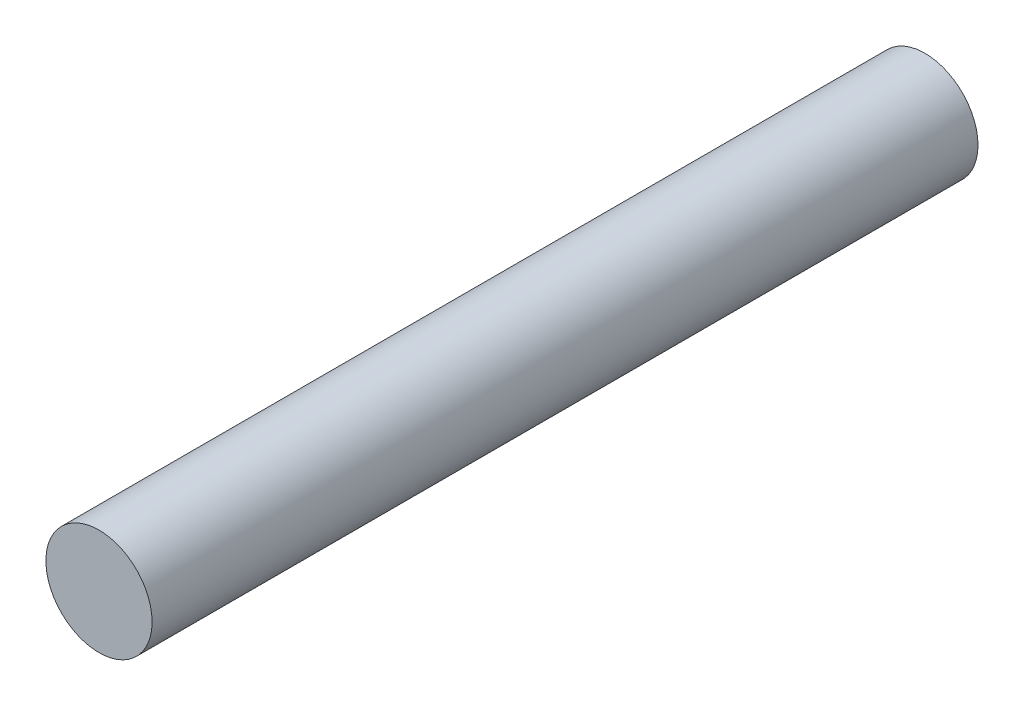
ISO-10303-21;
HEADER;
FILE_DESCRIPTION(('STEP AP214'),'2;1');
FILE_NAME('part.step','',(''),(''),'','','');
FILE_SCHEMA(('AUTOMOTIVE_DESIGN { 1 0 10303 214 1 1 1 1 }'));
ENDSEC;
DATA;
#1=APPLICATION_CONTEXT('core data for automotive mechanical design processes');
#2=APPLICATION_PROTOCOL_DEFINITION('international standard','automotive_design',2000,#1);
#3=PRODUCT_CONTEXT('',#1,'mechanical');
#4=PRODUCT('Part','Part','',(#3));
#5=PRODUCT_RELATED_PRODUCT_CATEGORY('part','',(#4));
#6=PRODUCT_DEFINITION_FORMATION('','',#4);
#7=PRODUCT_DEFINITION_CONTEXT('part definition',#1,'design');
#8=PRODUCT_DEFINITION('design','',#6,#7);
#9=PRODUCT_DEFINITION_SHAPE('','',#8);
#10=(LENGTH_UNIT() NAMED_UNIT(*) SI_UNIT(.MILLI.,.METRE.));
#11=(NAMED_UNIT(*) PLANE_ANGLE_UNIT() SI_UNIT($,.RADIAN.));
#12=(NAMED_UNIT(*) SI_UNIT($,.STERADIAN.) SOLID_ANGLE_UNIT());
#13=UNCERTAINTY_MEASURE_WITH_UNIT(LENGTH_MEASURE(1.E-05),#10,'distance_accuracy_value','');
#14=(GEOMETRIC_REPRESENTATION_CONTEXT(3) GLOBAL_UNCERTAINTY_ASSIGNED_CONTEXT((#13)) GLOBAL_UNIT_ASSIGNED_CONTEXT((#10,
#11,#12)) REPRESENTATION_CONTEXT('',''));
#15=CARTESIAN_POINT('',(0.,0.,0.));
#16=DIRECTION('',(0.,0.,1.));
#17=DIRECTION('',(1.,0.,0.));
#18=AXIS2_PLACEMENT_3D('',#15,#16,#17);
#19=CARTESIAN_POINT('',(0.,0.,140.));
#20=DIRECTION('',(0.,0.,-1.));
#21=DIRECTION('',(-1.,0.,0.));
#22=AXIS2_PLACEMENT_3D('',#19,#20,#21);
#23=CYLINDRICAL_SURFACE('',#22,9.);
#24=CARTESIAN_POINT('',(0.,0.,140.));
#25=DIRECTION('',(0.,0.,1.));
#26=DIRECTION('',(1.,0.,0.));
#27=AXIS2_PLACEMENT_3D('',#24,#25,#26);
#28=CIRCLE('',#27,9.);
#29=CARTESIAN_POINT('',(9.,0.,140.));
#30=VERTEX_POINT('',#29);
#31=EDGE_CURVE('E10',#30,#30,#28,.T.);
#32=ORIENTED_EDGE('',*,*,#31,.F.);
#33=EDGE_LOOP('',(#32));
#34=FACE_BOUND('',#33,.T.);
#35=CARTESIAN_POINT('',(0.,0.,0.));
#36=DIRECTION('',(0.,0.,1.));
#37=DIRECTION('',(1.,0.,0.));
#38=AXIS2_PLACEMENT_3D('',#35,#36,#37);
#39=CIRCLE('',#38,9.);
#40=CARTESIAN_POINT('',(9.,0.,0.));
#41=VERTEX_POINT('',#40);
#42=EDGE_CURVE('E36',#41,#41,#39,.T.);
#43=ORIENTED_EDGE('',*,*,#42,.T.);
#44=EDGE_LOOP('',(#43));
#45=FACE_BOUND('',#44,.T.);
#46=ADVANCED_FACE('F33',(#34,#45),#23,.T.);
#47=CARTESIAN_POINT('',(0.,0.,140.));
#48=DIRECTION('',(0.,0.,1.));
#49=DIRECTION('',(1.,0.,0.));
#50=AXIS2_PLACEMENT_3D('',#47,#48,#49);
#51=PLANE('',#50);
#52=ORIENTED_EDGE('',*,*,#31,.T.);
#53=EDGE_LOOP('',(#52));
#54=FACE_BOUND('',#53,.T.);
#55=ADVANCED_FACE('F48',(#54),#51,.T.);
#56=CARTESIAN_POINT('',(0.,0.,0.));
#57=DIRECTION('',(0.,0.,1.));
#58=DIRECTION('',(1.,0.,0.));
#59=AXIS2_PLACEMENT_3D('',#56,#57,#58);
#60=PLANE('',#59);
#61=ORIENTED_EDGE('',*,*,#42,.F.);
#62=EDGE_LOOP('',(#61));
#63=FACE_BOUND('',#62,.T.);
#64=ADVANCED_FACE('F46',(#63),#60,.F.);
#65=CLOSED_SHELL('',(#46,#55,#64));
#66=MANIFOLD_SOLID_BREP('B2',#65);
#67=ADVANCED_BREP_SHAPE_REPRESENTATION('',(#18,#66),#14);
#68=SHAPE_DEFINITION_REPRESENTATION(#9,#67);
ENDSEC;
END-ISO-10303-21;
